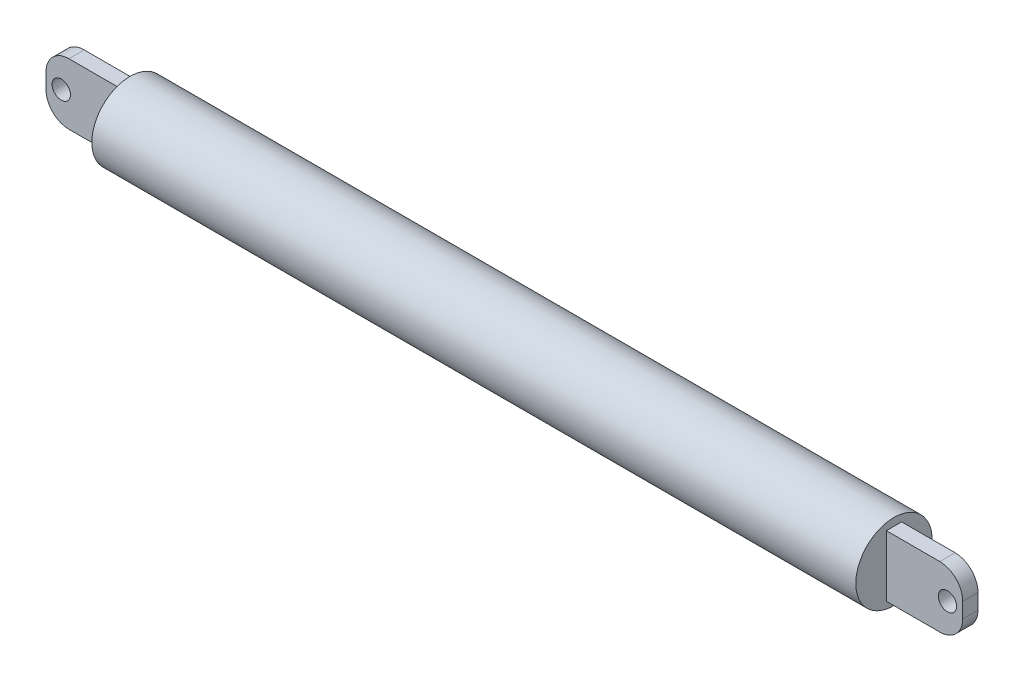
ISO-10303-21;
HEADER;
FILE_DESCRIPTION(('STEP AP214'),'2;1');
FILE_NAME('part.step','',(''),(''),'','','');
FILE_SCHEMA(('AUTOMOTIVE_DESIGN { 1 0 10303 214 1 1 1 1 }'));
ENDSEC;
DATA;
#1=APPLICATION_CONTEXT('core data for automotive mechanical design processes');
#2=APPLICATION_PROTOCOL_DEFINITION('international standard','automotive_design',2000,#1);
#3=PRODUCT_CONTEXT('',#1,'mechanical');
#4=PRODUCT('Part','Part','',(#3));
#5=PRODUCT_RELATED_PRODUCT_CATEGORY('part','',(#4));
#6=PRODUCT_DEFINITION_FORMATION('','',#4);
#7=PRODUCT_DEFINITION_CONTEXT('part definition',#1,'design');
#8=PRODUCT_DEFINITION('design','',#6,#7);
#9=PRODUCT_DEFINITION_SHAPE('','',#8);
#10=(LENGTH_UNIT() NAMED_UNIT(*) SI_UNIT(.MILLI.,.METRE.));
#11=(NAMED_UNIT(*) PLANE_ANGLE_UNIT() SI_UNIT($,.RADIAN.));
#12=(NAMED_UNIT(*) SI_UNIT($,.STERADIAN.) SOLID_ANGLE_UNIT());
#13=UNCERTAINTY_MEASURE_WITH_UNIT(LENGTH_MEASURE(1.E-05),#10,'distance_accuracy_value','');
#14=(GEOMETRIC_REPRESENTATION_CONTEXT(3) GLOBAL_UNCERTAINTY_ASSIGNED_CONTEXT((#13)) GLOBAL_UNIT_ASSIGNED_CONTEXT((#10,
#11,#12)) REPRESENTATION_CONTEXT('',''));
#15=CARTESIAN_POINT('',(0.,0.,0.));
#16=DIRECTION('',(0.,0.,1.));
#17=DIRECTION('',(1.,0.,0.));
#18=AXIS2_PLACEMENT_3D('',#15,#16,#17);
#19=CARTESIAN_POINT('',(-250.,25.,0.));
#20=DIRECTION('',(1.,0.,0.));
#21=DIRECTION('',(0.,0.,-1.));
#22=AXIS2_PLACEMENT_3D('',#19,#20,#21);
#23=PLANE('',#22);
#24=CARTESIAN_POINT('',(-250.,0.,0.));
#25=DIRECTION('',(-1.,0.,0.));
#26=DIRECTION('',(0.,0.,1.));
#27=AXIS2_PLACEMENT_3D('',#24,#25,#26);
#28=CIRCLE('',#27,25.);
#29=CARTESIAN_POINT('',(-250.,0.,25.));
#30=VERTEX_POINT('',#29);
#31=EDGE_CURVE('E11',#30,#30,#28,.T.);
#32=ORIENTED_EDGE('',*,*,#31,.T.);
#33=EDGE_LOOP('',(#32));
#34=FACE_BOUND('',#33,.T.);
#35=DIRECTION('',(0.,-1.,0.));
#36=VECTOR('',#35,1.);
#37=CARTESIAN_POINT('',(-250.,-20.,5.));
#38=LINE('',#37,#36);
#39=CARTESIAN_POINT('',(-250.,20.,5.));
#40=VERTEX_POINT('',#39);
#41=CARTESIAN_POINT('',(-250.,-20.,5.));
#42=VERTEX_POINT('',#41);
#43=EDGE_CURVE('E143',#40,#42,#38,.T.);
#44=ORIENTED_EDGE('',*,*,#43,.T.);
#45=DIRECTION('',(0.,0.,-1.));
#46=VECTOR('',#45,1.);
#47=CARTESIAN_POINT('',(-250.,-20.,5.));
#48=LINE('',#47,#46);
#49=CARTESIAN_POINT('',(-250.,-20.,-5.));
#50=VERTEX_POINT('',#49);
#51=EDGE_CURVE('E176',#42,#50,#48,.T.);
#52=ORIENTED_EDGE('',*,*,#51,.T.);
#53=DIRECTION('',(0.,-1.,0.));
#54=VECTOR('',#53,1.);
#55=CARTESIAN_POINT('',(-250.,-20.,-5.));
#56=LINE('',#55,#54);
#57=CARTESIAN_POINT('',(-250.,20.,-5.));
#58=VERTEX_POINT('',#57);
#59=EDGE_CURVE('E145',#58,#50,#56,.T.);
#60=ORIENTED_EDGE('',*,*,#59,.F.);
#61=DIRECTION('',(0.,0.,-1.));
#62=VECTOR('',#61,1.);
#63=CARTESIAN_POINT('',(-250.,20.,5.));
#64=LINE('',#63,#62);
#65=EDGE_CURVE('E160',#40,#58,#64,.T.);
#66=ORIENTED_EDGE('',*,*,#65,.F.);
#67=EDGE_LOOP('',(#44,#52,#60,#66));
#68=FACE_BOUND('',#67,.T.);
#69=ADVANCED_FACE('F35',(#34,#68),#23,.F.);
#70=CARTESIAN_POINT('',(250.,25.,0.));
#71=DIRECTION('',(-1.,0.,0.));
#72=DIRECTION('',(0.,0.,1.));
#73=AXIS2_PLACEMENT_3D('',#70,#71,#72);
#74=PLANE('',#73);
#75=CARTESIAN_POINT('',(250.,0.,0.));
#76=DIRECTION('',(-1.,0.,0.));
#77=DIRECTION('',(0.,0.,1.));
#78=AXIS2_PLACEMENT_3D('',#75,#76,#77);
#79=CIRCLE('',#78,25.);
#80=CARTESIAN_POINT('',(250.,0.,25.));
#81=VERTEX_POINT('',#80);
#82=EDGE_CURVE('E43',#81,#81,#79,.T.);
#83=ORIENTED_EDGE('',*,*,#82,.F.);
#84=EDGE_LOOP('',(#83));
#85=FACE_BOUND('',#84,.T.);
#86=DIRECTION('',(0.,0.,-1.));
#87=VECTOR('',#86,1.);
#88=CARTESIAN_POINT('',(250.,20.,5.));
#89=LINE('',#88,#87);
#90=CARTESIAN_POINT('',(250.,20.,5.));
#91=VERTEX_POINT('',#90);
#92=CARTESIAN_POINT('',(250.,20.,-5.));
#93=VERTEX_POINT('',#92);
#94=EDGE_CURVE('E228',#91,#93,#89,.T.);
#95=ORIENTED_EDGE('',*,*,#94,.T.);
#96=DIRECTION('',(0.,-1.,0.));
#97=VECTOR('',#96,1.);
#98=CARTESIAN_POINT('',(250.,-20.,-5.));
#99=LINE('',#98,#97);
#100=CARTESIAN_POINT('',(250.,-20.,-5.));
#101=VERTEX_POINT('',#100);
#102=EDGE_CURVE('E205',#93,#101,#99,.T.);
#103=ORIENTED_EDGE('',*,*,#102,.T.);
#104=DIRECTION('',(0.,0.,-1.));
#105=VECTOR('',#104,1.);
#106=CARTESIAN_POINT('',(250.,-20.,5.));
#107=LINE('',#106,#105);
#108=CARTESIAN_POINT('',(250.,-20.,5.));
#109=VERTEX_POINT('',#108);
#110=EDGE_CURVE('E225',#109,#101,#107,.T.);
#111=ORIENTED_EDGE('',*,*,#110,.F.);
#112=DIRECTION('',(0.,-1.,0.));
#113=VECTOR('',#112,1.);
#114=CARTESIAN_POINT('',(250.,-20.,5.));
#115=LINE('',#114,#113);
#116=EDGE_CURVE('E58',#91,#109,#115,.T.);
#117=ORIENTED_EDGE('',*,*,#116,.F.);
#118=EDGE_LOOP('',(#95,#103,#111,#117));
#119=FACE_BOUND('',#118,.T.);
#120=ADVANCED_FACE('F37',(#85,#119),#74,.F.);
#121=CARTESIAN_POINT('',(0.,0.,0.));
#122=DIRECTION('',(-1.,0.,0.));
#123=DIRECTION('',(0.,0.,1.));
#124=AXIS2_PLACEMENT_3D('',#121,#122,#123);
#125=CYLINDRICAL_SURFACE('',#124,25.);
#126=ORIENTED_EDGE('',*,*,#31,.F.);
#127=EDGE_LOOP('',(#126));
#128=FACE_BOUND('',#127,.T.);
#129=ORIENTED_EDGE('',*,*,#82,.T.);
#130=EDGE_LOOP('',(#129));
#131=FACE_BOUND('',#130,.T.);
#132=ADVANCED_FACE('F232',(#128,#131),#125,.T.);
#133=CARTESIAN_POINT('',(285.,5.,5.));
#134=DIRECTION('',(0.,0.,-1.));
#135=DIRECTION('',(-1.,0.,0.));
#136=AXIS2_PLACEMENT_3D('',#133,#134,#135);
#137=PLANE('',#136);
#138=DIRECTION('',(-1.,0.,0.));
#139=VECTOR('',#138,1.);
#140=CARTESIAN_POINT('',(250.,20.,5.));
#141=LINE('',#140,#139);
#142=CARTESIAN_POINT('',(285.,20.,5.));
#143=VERTEX_POINT('',#142);
#144=EDGE_CURVE('E190',#143,#91,#141,.T.);
#145=ORIENTED_EDGE('',*,*,#144,.T.);
#146=ORIENTED_EDGE('',*,*,#116,.T.);
#147=DIRECTION('',(1.,0.,0.));
#148=VECTOR('',#147,1.);
#149=CARTESIAN_POINT('',(250.,-20.,5.));
#150=LINE('',#149,#148);
#151=CARTESIAN_POINT('',(285.,-20.,5.));
#152=VERTEX_POINT('',#151);
#153=EDGE_CURVE('E194',#109,#152,#150,.T.);
#154=ORIENTED_EDGE('',*,*,#153,.T.);
#155=CARTESIAN_POINT('',(285.,-5.,5.));
#156=DIRECTION('',(0.,0.,1.));
#157=DIRECTION('',(1.,0.,0.));
#158=AXIS2_PLACEMENT_3D('',#155,#156,#157);
#159=CIRCLE('',#158,15.);
#160=CARTESIAN_POINT('',(300.,-4.99999999999989,5.));
#161=VERTEX_POINT('',#160);
#162=EDGE_CURVE('E196',#152,#161,#159,.T.);
#163=ORIENTED_EDGE('',*,*,#162,.T.);
#164=DIRECTION('',(0.,1.,0.));
#165=VECTOR('',#164,1.);
#166=CARTESIAN_POINT('',(300.,4.9999999999999,5.));
#167=LINE('',#166,#165);
#168=CARTESIAN_POINT('',(300.,4.9999999999999,5.));
#169=VERTEX_POINT('',#168);
#170=EDGE_CURVE('E198',#161,#169,#167,.T.);
#171=ORIENTED_EDGE('',*,*,#170,.T.);
#172=CARTESIAN_POINT('',(285.,5.,5.));
#173=DIRECTION('',(0.,0.,1.));
#174=DIRECTION('',(-1.,0.,0.));
#175=AXIS2_PLACEMENT_3D('',#172,#173,#174);
#176=CIRCLE('',#175,15.);
#177=EDGE_CURVE('E200',#169,#143,#176,.T.);
#178=ORIENTED_EDGE('',*,*,#177,.T.);
#179=EDGE_LOOP('',(#145,#146,#154,#163,#171,#178));
#180=FACE_BOUND('',#179,.T.);
#181=CARTESIAN_POINT('',(290.,0.,5.));
#182=DIRECTION('',(0.,0.,1.));
#183=DIRECTION('',(1.,0.,0.));
#184=AXIS2_PLACEMENT_3D('',#181,#182,#183);
#185=CIRCLE('',#184,5.99999999999999);
#186=CARTESIAN_POINT('',(296.,0.,5.));
#187=VERTEX_POINT('',#186);
#188=EDGE_CURVE('E184',#187,#187,#185,.T.);
#189=ORIENTED_EDGE('',*,*,#188,.F.);
#190=EDGE_LOOP('',(#189));
#191=FACE_BOUND('',#190,.T.);
#192=ADVANCED_FACE('F265',(#180,#191),#137,.F.);
#193=CARTESIAN_POINT('',(285.,5.,-5.));
#194=DIRECTION('',(0.,0.,-1.));
#195=DIRECTION('',(-1.,0.,0.));
#196=AXIS2_PLACEMENT_3D('',#193,#194,#195);
#197=PLANE('',#196);
#198=DIRECTION('',(-1.,0.,0.));
#199=VECTOR('',#198,1.);
#200=CARTESIAN_POINT('',(250.,20.,-5.));
#201=LINE('',#200,#199);
#202=CARTESIAN_POINT('',(285.,20.,-5.));
#203=VERTEX_POINT('',#202);
#204=EDGE_CURVE('E187',#203,#93,#201,.T.);
#205=ORIENTED_EDGE('',*,*,#204,.F.);
#206=CARTESIAN_POINT('',(285.,5.,-5.));
#207=DIRECTION('',(0.,0.,1.));
#208=DIRECTION('',(-1.,0.,0.));
#209=AXIS2_PLACEMENT_3D('',#206,#207,#208);
#210=CIRCLE('',#209,15.);
#211=CARTESIAN_POINT('',(300.,4.9999999999999,-5.));
#212=VERTEX_POINT('',#211);
#213=EDGE_CURVE('E192',#212,#203,#210,.T.);
#214=ORIENTED_EDGE('',*,*,#213,.F.);
#215=DIRECTION('',(0.,1.,0.));
#216=VECTOR('',#215,1.);
#217=CARTESIAN_POINT('',(300.,4.9999999999999,-5.));
#218=LINE('',#217,#216);
#219=CARTESIAN_POINT('',(300.,-4.99999999999989,-5.));
#220=VERTEX_POINT('',#219);
#221=EDGE_CURVE('E211',#220,#212,#218,.T.);
#222=ORIENTED_EDGE('',*,*,#221,.F.);
#223=CARTESIAN_POINT('',(285.,-5.,-5.));
#224=DIRECTION('',(0.,0.,1.));
#225=DIRECTION('',(1.,0.,0.));
#226=AXIS2_PLACEMENT_3D('',#223,#224,#225);
#227=CIRCLE('',#226,15.);
#228=CARTESIAN_POINT('',(285.,-20.,-5.));
#229=VERTEX_POINT('',#228);
#230=EDGE_CURVE('E209',#229,#220,#227,.T.);
#231=ORIENTED_EDGE('',*,*,#230,.F.);
#232=DIRECTION('',(1.,0.,0.));
#233=VECTOR('',#232,1.);
#234=CARTESIAN_POINT('',(250.,-20.,-5.));
#235=LINE('',#234,#233);
#236=EDGE_CURVE('E207',#101,#229,#235,.T.);
#237=ORIENTED_EDGE('',*,*,#236,.F.);
#238=ORIENTED_EDGE('',*,*,#102,.F.);
#239=EDGE_LOOP('',(#205,#214,#222,#231,#237,#238));
#240=FACE_BOUND('',#239,.T.);
#241=CARTESIAN_POINT('',(290.,0.,-5.));
#242=DIRECTION('',(0.,0.,1.));
#243=DIRECTION('',(1.,0.,0.));
#244=AXIS2_PLACEMENT_3D('',#241,#242,#243);
#245=CIRCLE('',#244,5.99999999999999);
#246=CARTESIAN_POINT('',(296.,0.,-5.));
#247=VERTEX_POINT('',#246);
#248=EDGE_CURVE('E132',#247,#247,#245,.T.);
#249=ORIENTED_EDGE('',*,*,#248,.T.);
#250=EDGE_LOOP('',(#249));
#251=FACE_BOUND('',#250,.T.);
#252=ADVANCED_FACE('F242',(#240,#251),#197,.T.);
#253=CARTESIAN_POINT('',(250.,20.,5.));
#254=DIRECTION('',(0.,-1.,0.));
#255=DIRECTION('',(0.,0.,-1.));
#256=AXIS2_PLACEMENT_3D('',#253,#254,#255);
#257=PLANE('',#256);
#258=ORIENTED_EDGE('',*,*,#204,.T.);
#259=ORIENTED_EDGE('',*,*,#94,.F.);
#260=ORIENTED_EDGE('',*,*,#144,.F.);
#261=DIRECTION('',(0.,0.,-1.));
#262=VECTOR('',#261,1.);
#263=CARTESIAN_POINT('',(285.,20.,5.));
#264=LINE('',#263,#262);
#265=EDGE_CURVE('E202',#143,#203,#264,.T.);
#266=ORIENTED_EDGE('',*,*,#265,.T.);
#267=EDGE_LOOP('',(#258,#259,#260,#266));
#268=FACE_BOUND('',#267,.T.);
#269=ADVANCED_FACE('F246',(#268),#257,.F.);
#270=CARTESIAN_POINT('',(250.,-20.,5.));
#271=DIRECTION('',(0.,1.,0.));
#272=DIRECTION('',(0.,0.,1.));
#273=AXIS2_PLACEMENT_3D('',#270,#271,#272);
#274=PLANE('',#273);
#275=ORIENTED_EDGE('',*,*,#236,.T.);
#276=DIRECTION('',(0.,0.,-1.));
#277=VECTOR('',#276,1.);
#278=CARTESIAN_POINT('',(285.,-20.,5.));
#279=LINE('',#278,#277);
#280=EDGE_CURVE('E222',#152,#229,#279,.T.);
#281=ORIENTED_EDGE('',*,*,#280,.F.);
#282=ORIENTED_EDGE('',*,*,#153,.F.);
#283=ORIENTED_EDGE('',*,*,#110,.T.);
#284=EDGE_LOOP('',(#275,#281,#282,#283));
#285=FACE_BOUND('',#284,.T.);
#286=ADVANCED_FACE('F263',(#285),#274,.F.);
#287=CARTESIAN_POINT('',(285.,-5.,5.));
#288=DIRECTION('',(0.,0.,-1.));
#289=DIRECTION('',(-1.,0.,0.));
#290=AXIS2_PLACEMENT_3D('',#287,#288,#289);
#291=CYLINDRICAL_SURFACE('',#290,15.);
#292=ORIENTED_EDGE('',*,*,#230,.T.);
#293=DIRECTION('',(0.,0.,-1.));
#294=VECTOR('',#293,1.);
#295=CARTESIAN_POINT('',(300.,-4.99999999999989,5.));
#296=LINE('',#295,#294);
#297=EDGE_CURVE('E219',#161,#220,#296,.T.);
#298=ORIENTED_EDGE('',*,*,#297,.F.);
#299=ORIENTED_EDGE('',*,*,#162,.F.);
#300=ORIENTED_EDGE('',*,*,#280,.T.);
#301=EDGE_LOOP('',(#292,#298,#299,#300));
#302=FACE_BOUND('',#301,.T.);
#303=ADVANCED_FACE('F259',(#302),#291,.T.);
#304=CARTESIAN_POINT('',(300.,4.9999999999999,5.));
#305=DIRECTION('',(-1.,0.,0.));
#306=DIRECTION('',(0.,0.,1.));
#307=AXIS2_PLACEMENT_3D('',#304,#305,#306);
#308=PLANE('',#307);
#309=ORIENTED_EDGE('',*,*,#221,.T.);
#310=DIRECTION('',(0.,0.,-1.));
#311=VECTOR('',#310,1.);
#312=CARTESIAN_POINT('',(300.,4.9999999999999,5.));
#313=LINE('',#312,#311);
#314=EDGE_CURVE('E216',#169,#212,#313,.T.);
#315=ORIENTED_EDGE('',*,*,#314,.F.);
#316=ORIENTED_EDGE('',*,*,#170,.F.);
#317=ORIENTED_EDGE('',*,*,#297,.T.);
#318=EDGE_LOOP('',(#309,#315,#316,#317));
#319=FACE_BOUND('',#318,.T.);
#320=ADVANCED_FACE('F254',(#319),#308,.F.);
#321=CARTESIAN_POINT('',(285.,5.,5.));
#322=DIRECTION('',(0.,0.,-1.));
#323=DIRECTION('',(-1.,0.,0.));
#324=AXIS2_PLACEMENT_3D('',#321,#322,#323);
#325=CYLINDRICAL_SURFACE('',#324,15.);
#326=ORIENTED_EDGE('',*,*,#213,.T.);
#327=ORIENTED_EDGE('',*,*,#265,.F.);
#328=ORIENTED_EDGE('',*,*,#177,.F.);
#329=ORIENTED_EDGE('',*,*,#314,.T.);
#330=EDGE_LOOP('',(#326,#327,#328,#329));
#331=FACE_BOUND('',#330,.T.);
#332=ADVANCED_FACE('F250',(#331),#325,.T.);
#333=CARTESIAN_POINT('',(290.,0.,5.));
#334=DIRECTION('',(0.,0.,-1.));
#335=DIRECTION('',(-1.,0.,0.));
#336=AXIS2_PLACEMENT_3D('',#333,#334,#335);
#337=CYLINDRICAL_SURFACE('',#336,5.99999999999999);
#338=ORIENTED_EDGE('',*,*,#188,.T.);
#339=EDGE_LOOP('',(#338));
#340=FACE_BOUND('',#339,.T.);
#341=ORIENTED_EDGE('',*,*,#248,.F.);
#342=EDGE_LOOP('',(#341));
#343=FACE_BOUND('',#342,.T.);
#344=ADVANCED_FACE('F271',(#340,#343),#337,.F.);
#345=CARTESIAN_POINT('',(-250.,20.,5.));
#346=DIRECTION('',(0.,1.,0.));
#347=DIRECTION('',(0.,0.,1.));
#348=AXIS2_PLACEMENT_3D('',#345,#346,#347);
#349=PLANE('',#348);
#350=DIRECTION('',(1.,0.,0.));
#351=VECTOR('',#350,1.);
#352=CARTESIAN_POINT('',(-250.,20.,-5.));
#353=LINE('',#352,#351);
#354=CARTESIAN_POINT('',(-285.,20.,-5.));
#355=VERTEX_POINT('',#354);
#356=EDGE_CURVE('E50',#355,#58,#353,.T.);
#357=ORIENTED_EDGE('',*,*,#356,.F.);
#358=DIRECTION('',(0.,0.,-1.));
#359=VECTOR('',#358,1.);
#360=CARTESIAN_POINT('',(-285.,20.,5.));
#361=LINE('',#360,#359);
#362=CARTESIAN_POINT('',(-285.,20.,5.));
#363=VERTEX_POINT('',#362);
#364=EDGE_CURVE('E124',#363,#355,#361,.T.);
#365=ORIENTED_EDGE('',*,*,#364,.F.);
#366=DIRECTION('',(1.,0.,0.));
#367=VECTOR('',#366,1.);
#368=CARTESIAN_POINT('',(-250.,20.,5.));
#369=LINE('',#368,#367);
#370=EDGE_CURVE('E127',#363,#40,#369,.T.);
#371=ORIENTED_EDGE('',*,*,#370,.T.);
#372=ORIENTED_EDGE('',*,*,#65,.T.);
#373=EDGE_LOOP('',(#357,#365,#371,#372));
#374=FACE_BOUND('',#373,.T.);
#375=ADVANCED_FACE('F126',(#374),#349,.T.);
#376=CARTESIAN_POINT('',(-285.,5.,5.));
#377=DIRECTION('',(0.,0.,-1.));
#378=DIRECTION('',(-1.,0.,0.));
#379=AXIS2_PLACEMENT_3D('',#376,#377,#378);
#380=CYLINDRICAL_SURFACE('',#379,15.);
#381=CARTESIAN_POINT('',(-285.,5.,-5.));
#382=DIRECTION('',(0.,0.,-1.));
#383=DIRECTION('',(1.,0.,0.));
#384=AXIS2_PLACEMENT_3D('',#381,#382,#383);
#385=CIRCLE('',#384,15.);
#386=CARTESIAN_POINT('',(-300.,4.9999999999999,-5.));
#387=VERTEX_POINT('',#386);
#388=EDGE_CURVE('E162',#387,#355,#385,.T.);
#389=ORIENTED_EDGE('',*,*,#388,.F.);
#390=DIRECTION('',(0.,0.,-1.));
#391=VECTOR('',#390,1.);
#392=CARTESIAN_POINT('',(-300.,4.9999999999999,5.));
#393=LINE('',#392,#391);
#394=CARTESIAN_POINT('',(-300.,4.9999999999999,5.));
#395=VERTEX_POINT('',#394);
#396=EDGE_CURVE('E133',#395,#387,#393,.T.);
#397=ORIENTED_EDGE('',*,*,#396,.F.);
#398=CARTESIAN_POINT('',(-285.,5.,5.));
#399=DIRECTION('',(0.,0.,-1.));
#400=DIRECTION('',(1.,0.,0.));
#401=AXIS2_PLACEMENT_3D('',#398,#399,#400);
#402=CIRCLE('',#401,15.);
#403=EDGE_CURVE('E139',#395,#363,#402,.T.);
#404=ORIENTED_EDGE('',*,*,#403,.T.);
#405=ORIENTED_EDGE('',*,*,#364,.T.);
#406=EDGE_LOOP('',(#389,#397,#404,#405));
#407=FACE_BOUND('',#406,.T.);
#408=ADVANCED_FACE('F147',(#407),#380,.T.);
#409=CARTESIAN_POINT('',(-300.,4.9999999999999,5.));
#410=DIRECTION('',(-1.,0.,0.));
#411=DIRECTION('',(0.,0.,1.));
#412=AXIS2_PLACEMENT_3D('',#409,#410,#411);
#413=PLANE('',#412);
#414=DIRECTION('',(0.,1.,0.));
#415=VECTOR('',#414,1.);
#416=CARTESIAN_POINT('',(-300.,4.9999999999999,-5.));
#417=LINE('',#416,#415);
#418=CARTESIAN_POINT('',(-300.,-4.99999999999989,-5.));
#419=VERTEX_POINT('',#418);
#420=EDGE_CURVE('E165',#419,#387,#417,.T.);
#421=ORIENTED_EDGE('',*,*,#420,.F.);
#422=DIRECTION('',(0.,0.,-1.));
#423=VECTOR('',#422,1.);
#424=CARTESIAN_POINT('',(-300.,-4.99999999999989,5.));
#425=LINE('',#424,#423);
#426=CARTESIAN_POINT('',(-300.,-4.99999999999989,5.));
#427=VERTEX_POINT('',#426);
#428=EDGE_CURVE('E181',#427,#419,#425,.T.);
#429=ORIENTED_EDGE('',*,*,#428,.F.);
#430=DIRECTION('',(0.,1.,0.));
#431=VECTOR('',#430,1.);
#432=CARTESIAN_POINT('',(-300.,4.9999999999999,5.));
#433=LINE('',#432,#431);
#434=EDGE_CURVE('E148',#427,#395,#433,.T.);
#435=ORIENTED_EDGE('',*,*,#434,.T.);
#436=ORIENTED_EDGE('',*,*,#396,.T.);
#437=EDGE_LOOP('',(#421,#429,#435,#436));
#438=FACE_BOUND('',#437,.T.);
#439=ADVANCED_FACE('F318',(#438),#413,.T.);
#440=CARTESIAN_POINT('',(-285.,-5.,5.));
#441=DIRECTION('',(0.,0.,-1.));
#442=DIRECTION('',(-1.,0.,0.));
#443=AXIS2_PLACEMENT_3D('',#440,#441,#442);
#444=CYLINDRICAL_SURFACE('',#443,15.);
#445=CARTESIAN_POINT('',(-285.,-5.,-5.));
#446=DIRECTION('',(0.,0.,-1.));
#447=DIRECTION('',(-1.,0.,0.));
#448=AXIS2_PLACEMENT_3D('',#445,#446,#447);
#449=CIRCLE('',#448,15.);
#450=CARTESIAN_POINT('',(-285.,-20.,-5.));
#451=VERTEX_POINT('',#450);
#452=EDGE_CURVE('E168',#451,#419,#449,.T.);
#453=ORIENTED_EDGE('',*,*,#452,.F.);
#454=DIRECTION('',(0.,0.,-1.));
#455=VECTOR('',#454,1.);
#456=CARTESIAN_POINT('',(-285.,-20.,5.));
#457=LINE('',#456,#455);
#458=CARTESIAN_POINT('',(-285.,-20.,5.));
#459=VERTEX_POINT('',#458);
#460=EDGE_CURVE('E179',#459,#451,#457,.T.);
#461=ORIENTED_EDGE('',*,*,#460,.F.);
#462=CARTESIAN_POINT('',(-285.,-5.,5.));
#463=DIRECTION('',(0.,0.,-1.));
#464=DIRECTION('',(-1.,0.,0.));
#465=AXIS2_PLACEMENT_3D('',#462,#463,#464);
#466=CIRCLE('',#465,15.);
#467=EDGE_CURVE('E150',#459,#427,#466,.T.);
#468=ORIENTED_EDGE('',*,*,#467,.T.);
#469=ORIENTED_EDGE('',*,*,#428,.T.);
#470=EDGE_LOOP('',(#453,#461,#468,#469));
#471=FACE_BOUND('',#470,.T.);
#472=ADVANCED_FACE('F325',(#471),#444,.T.);
#473=CARTESIAN_POINT('',(-250.,-20.,5.));
#474=DIRECTION('',(0.,-1.,0.));
#475=DIRECTION('',(0.,0.,-1.));
#476=AXIS2_PLACEMENT_3D('',#473,#474,#475);
#477=PLANE('',#476);
#478=DIRECTION('',(-1.,0.,0.));
#479=VECTOR('',#478,1.);
#480=CARTESIAN_POINT('',(-250.,-20.,-5.));
#481=LINE('',#480,#479);
#482=EDGE_CURVE('E171',#50,#451,#481,.T.);
#483=ORIENTED_EDGE('',*,*,#482,.F.);
#484=ORIENTED_EDGE('',*,*,#51,.F.);
#485=DIRECTION('',(-1.,0.,0.));
#486=VECTOR('',#485,1.);
#487=CARTESIAN_POINT('',(-250.,-20.,5.));
#488=LINE('',#487,#486);
#489=EDGE_CURVE('E156',#42,#459,#488,.T.);
#490=ORIENTED_EDGE('',*,*,#489,.T.);
#491=ORIENTED_EDGE('',*,*,#460,.T.);
#492=EDGE_LOOP('',(#483,#484,#490,#491));
#493=FACE_BOUND('',#492,.T.);
#494=ADVANCED_FACE('F333',(#493),#477,.T.);
#495=CARTESIAN_POINT('',(-285.,5.,5.));
#496=DIRECTION('',(0.,0.,-1.));
#497=DIRECTION('',(1.,0.,0.));
#498=AXIS2_PLACEMENT_3D('',#495,#496,#497);
#499=PLANE('',#498);
#500=CARTESIAN_POINT('',(-290.,0.,5.));
#501=DIRECTION('',(0.,0.,-1.));
#502=DIRECTION('',(-1.,0.,0.));
#503=AXIS2_PLACEMENT_3D('',#500,#501,#502);
#504=CIRCLE('',#503,5.99999999999999);
#505=CARTESIAN_POINT('',(-296.,0.,5.));
#506=VERTEX_POINT('',#505);
#507=EDGE_CURVE('E163',#506,#506,#504,.T.);
#508=ORIENTED_EDGE('',*,*,#507,.T.);
#509=EDGE_LOOP('',(#508));
#510=FACE_BOUND('',#509,.T.);
#511=ORIENTED_EDGE('',*,*,#370,.F.);
#512=ORIENTED_EDGE('',*,*,#403,.F.);
#513=ORIENTED_EDGE('',*,*,#434,.F.);
#514=ORIENTED_EDGE('',*,*,#467,.F.);
#515=ORIENTED_EDGE('',*,*,#489,.F.);
#516=ORIENTED_EDGE('',*,*,#43,.F.);
#517=EDGE_LOOP('',(#511,#512,#513,#514,#515,#516));
#518=FACE_BOUND('',#517,.T.);
#519=ADVANCED_FACE('F137',(#510,#518),#499,.F.);
#520=CARTESIAN_POINT('',(-285.,5.,-5.));
#521=DIRECTION('',(0.,0.,-1.));
#522=DIRECTION('',(1.,0.,0.));
#523=AXIS2_PLACEMENT_3D('',#520,#521,#522);
#524=PLANE('',#523);
#525=CARTESIAN_POINT('',(-290.,0.,-5.));
#526=DIRECTION('',(0.,0.,-1.));
#527=DIRECTION('',(-1.,0.,0.));
#528=AXIS2_PLACEMENT_3D('',#525,#526,#527);
#529=CIRCLE('',#528,5.99999999999999);
#530=CARTESIAN_POINT('',(-296.,0.,-5.));
#531=VERTEX_POINT('',#530);
#532=EDGE_CURVE('E440',#531,#531,#529,.T.);
#533=ORIENTED_EDGE('',*,*,#532,.F.);
#534=EDGE_LOOP('',(#533));
#535=FACE_BOUND('',#534,.T.);
#536=ORIENTED_EDGE('',*,*,#356,.T.);
#537=ORIENTED_EDGE('',*,*,#59,.T.);
#538=ORIENTED_EDGE('',*,*,#482,.T.);
#539=ORIENTED_EDGE('',*,*,#452,.T.);
#540=ORIENTED_EDGE('',*,*,#420,.T.);
#541=ORIENTED_EDGE('',*,*,#388,.T.);
#542=EDGE_LOOP('',(#536,#537,#538,#539,#540,#541));
#543=FACE_BOUND('',#542,.T.);
#544=ADVANCED_FACE('F348',(#535,#543),#524,.T.);
#545=CARTESIAN_POINT('',(-290.,0.,5.));
#546=DIRECTION('',(0.,0.,-1.));
#547=DIRECTION('',(-1.,0.,0.));
#548=AXIS2_PLACEMENT_3D('',#545,#546,#547);
#549=CYLINDRICAL_SURFACE('',#548,5.99999999999999);
#550=ORIENTED_EDGE('',*,*,#507,.F.);
#551=EDGE_LOOP('',(#550));
#552=FACE_BOUND('',#551,.T.);
#553=ORIENTED_EDGE('',*,*,#532,.T.);
#554=EDGE_LOOP('',(#553));
#555=FACE_BOUND('',#554,.T.);
#556=ADVANCED_FACE('F356',(#552,#555),#549,.F.);
#557=CLOSED_SHELL('',(#69,#120,#132,#192,#252,#269,#286,#303,#320,#332,#344,#375,#408,#439,#472,
#494,#519,#544,#556));
#558=MANIFOLD_SOLID_BREP('B2',#557);
#559=ADVANCED_BREP_SHAPE_REPRESENTATION('',(#18,#558),#14);
#560=SHAPE_DEFINITION_REPRESENTATION(#9,#559);
ENDSEC;
END-ISO-10303-21;
